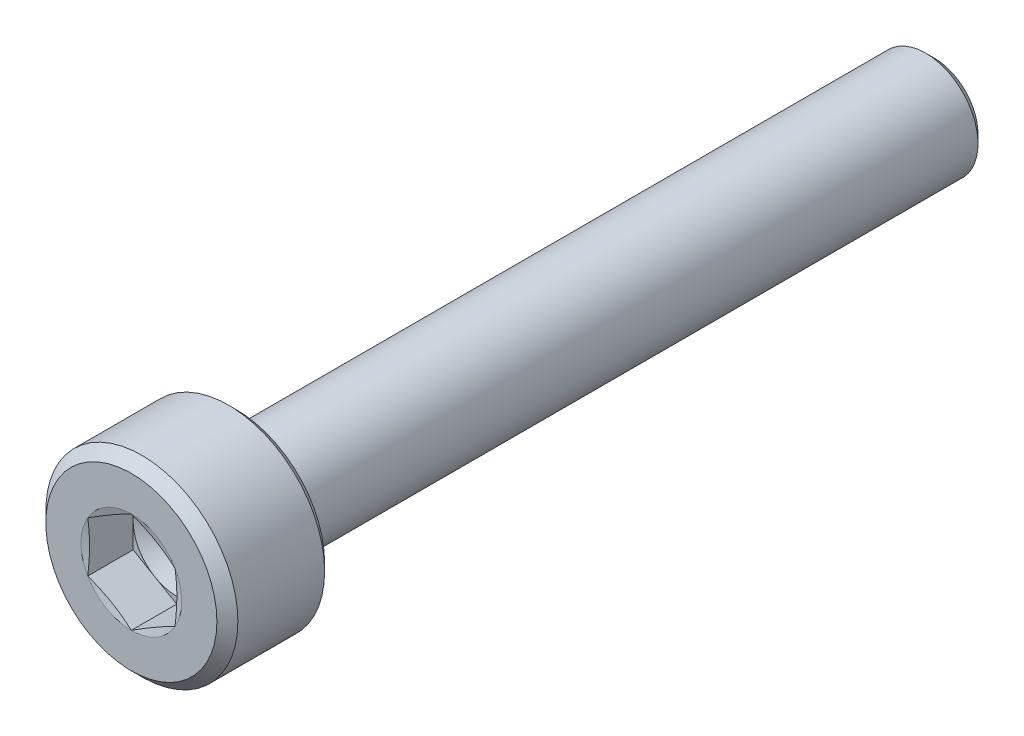
ISO-10303-21;
HEADER;
FILE_DESCRIPTION(('STEP AP214'),'2;1');
FILE_NAME('part.step','',(''),(''),'','','');
FILE_SCHEMA(('AUTOMOTIVE_DESIGN { 1 0 10303 214 1 1 1 1 }'));
ENDSEC;
DATA;
#1=APPLICATION_CONTEXT('core data for automotive mechanical design processes');
#2=APPLICATION_PROTOCOL_DEFINITION('international standard','automotive_design',2000,#1);
#3=PRODUCT_CONTEXT('',#1,'mechanical');
#4=PRODUCT('Part','Part','',(#3));
#5=PRODUCT_RELATED_PRODUCT_CATEGORY('part','',(#4));
#6=PRODUCT_DEFINITION_FORMATION('','',#4);
#7=PRODUCT_DEFINITION_CONTEXT('part definition',#1,'design');
#8=PRODUCT_DEFINITION('design','',#6,#7);
#9=PRODUCT_DEFINITION_SHAPE('','',#8);
#10=(LENGTH_UNIT() NAMED_UNIT(*) SI_UNIT(.MILLI.,.METRE.));
#11=(NAMED_UNIT(*) PLANE_ANGLE_UNIT() SI_UNIT($,.RADIAN.));
#12=(NAMED_UNIT(*) SI_UNIT($,.STERADIAN.) SOLID_ANGLE_UNIT());
#13=UNCERTAINTY_MEASURE_WITH_UNIT(LENGTH_MEASURE(1.E-05),#10,'distance_accuracy_value','');
#14=(GEOMETRIC_REPRESENTATION_CONTEXT(3) GLOBAL_UNCERTAINTY_ASSIGNED_CONTEXT((#13)) GLOBAL_UNIT_ASSIGNED_CONTEXT((#10,
#11,#12)) REPRESENTATION_CONTEXT('',''));
#15=CARTESIAN_POINT('',(0.,0.,0.));
#16=DIRECTION('',(0.,0.,1.));
#17=DIRECTION('',(1.,0.,0.));
#18=AXIS2_PLACEMENT_3D('',#15,#16,#17);
#19=CARTESIAN_POINT('',(0.,0.,0.));
#20=DIRECTION('',(0.,0.,-1.));
#21=DIRECTION('',(-1.,0.,0.));
#22=AXIS2_PLACEMENT_3D('',#19,#20,#21);
#23=PLANE('',#22);
#24=CARTESIAN_POINT('',(0.,0.,0.));
#25=DIRECTION('',(0.,0.,1.));
#26=DIRECTION('',(1.,0.,0.));
#27=AXIS2_PLACEMENT_3D('',#24,#25,#26);
#28=CIRCLE('',#27,2.44999999999999);
#29=CARTESIAN_POINT('',(2.44999999999999,0.,0.));
#30=VERTEX_POINT('',#29);
#31=EDGE_CURVE('E229',#30,#30,#28,.T.);
#32=ORIENTED_EDGE('',*,*,#31,.T.);
#33=EDGE_LOOP('',(#32));
#34=FACE_BOUND('',#33,.T.);
#35=CARTESIAN_POINT('',(0.,0.,0.));
#36=DIRECTION('',(0.,0.,1.));
#37=DIRECTION('',(1.,0.,0.));
#38=AXIS2_PLACEMENT_3D('',#35,#36,#37);
#39=CIRCLE('',#38,1.44337567297407);
#40=CARTESIAN_POINT('',(-1.25,-0.721687836487033,0.));
#41=VERTEX_POINT('',#40);
#42=CARTESIAN_POINT('',(0.,-1.44337567297407,0.));
#43=VERTEX_POINT('',#42);
#44=EDGE_CURVE('E155',#41,#43,#39,.T.);
#45=ORIENTED_EDGE('',*,*,#44,.F.);
#46=CARTESIAN_POINT('',(-1.25,0.721687836487033,0.));
#47=VERTEX_POINT('',#46);
#48=EDGE_CURVE('E154',#47,#41,#39,.T.);
#49=ORIENTED_EDGE('',*,*,#48,.F.);
#50=CARTESIAN_POINT('',(0.,1.44337567297407,0.));
#51=VERTEX_POINT('',#50);
#52=EDGE_CURVE('E121',#51,#47,#39,.T.);
#53=ORIENTED_EDGE('',*,*,#52,.F.);
#54=CARTESIAN_POINT('',(1.25,0.721687836487034,0.));
#55=VERTEX_POINT('',#54);
#56=EDGE_CURVE('E115',#55,#51,#39,.T.);
#57=ORIENTED_EDGE('',*,*,#56,.F.);
#58=CARTESIAN_POINT('',(1.25,-0.721687836487031,0.));
#59=VERTEX_POINT('',#58);
#60=EDGE_CURVE('E123',#59,#55,#39,.T.);
#61=ORIENTED_EDGE('',*,*,#60,.F.);
#62=EDGE_CURVE('E313',#43,#59,#39,.T.);
#63=ORIENTED_EDGE('',*,*,#62,.F.);
#64=EDGE_LOOP('',(#45,#49,#53,#57,#61,#63));
#65=FACE_BOUND('',#64,.T.);
#66=ADVANCED_FACE('F38',(#34,#65),#23,.F.);
#67=CARTESIAN_POINT('',(0.,0.,-0.3));
#68=DIRECTION('',(0.,0.,-1.));
#69=DIRECTION('',(-1.,0.,0.));
#70=AXIS2_PLACEMENT_3D('',#67,#68,#69);
#71=CONICAL_SURFACE('',#70,2.75,0.78539816339746);
#72=ORIENTED_EDGE('',*,*,#31,.F.);
#73=EDGE_LOOP('',(#72));
#74=FACE_BOUND('',#73,.T.);
#75=CARTESIAN_POINT('',(0.,0.,-0.3));
#76=DIRECTION('',(0.,0.,1.));
#77=DIRECTION('',(1.,0.,0.));
#78=AXIS2_PLACEMENT_3D('',#75,#76,#77);
#79=CIRCLE('',#78,2.75);
#80=CARTESIAN_POINT('',(2.75,0.,-0.3));
#81=VERTEX_POINT('',#80);
#82=EDGE_CURVE('E231',#81,#81,#79,.T.);
#83=ORIENTED_EDGE('',*,*,#82,.T.);
#84=EDGE_LOOP('',(#83));
#85=FACE_BOUND('',#84,.T.);
#86=ADVANCED_FACE('F220',(#74,#85),#71,.T.);
#87=CARTESIAN_POINT('',(0.,0.,0.));
#88=DIRECTION('',(0.,0.,1.));
#89=DIRECTION('',(1.,0.,0.));
#90=AXIS2_PLACEMENT_3D('',#87,#88,#89);
#91=CYLINDRICAL_SURFACE('',#90,2.75);
#92=ORIENTED_EDGE('',*,*,#82,.F.);
#93=EDGE_LOOP('',(#92));
#94=FACE_BOUND('',#93,.T.);
#95=CARTESIAN_POINT('',(0.,0.,-2.785));
#96=DIRECTION('',(0.,0.,1.));
#97=DIRECTION('',(1.,0.,0.));
#98=AXIS2_PLACEMENT_3D('',#95,#96,#97);
#99=CIRCLE('',#98,2.75);
#100=CARTESIAN_POINT('',(2.75,0.,-2.785));
#101=VERTEX_POINT('',#100);
#102=EDGE_CURVE('E234',#101,#101,#99,.T.);
#103=ORIENTED_EDGE('',*,*,#102,.T.);
#104=EDGE_LOOP('',(#103));
#105=FACE_BOUND('',#104,.T.);
#106=ADVANCED_FACE('F225',(#94,#105),#91,.T.);
#107=CARTESIAN_POINT('',(0.,0.,-3.));
#108=DIRECTION('',(0.,0.,1.));
#109=DIRECTION('',(1.,0.,0.));
#110=AXIS2_PLACEMENT_3D('',#107,#108,#109);
#111=CONICAL_SURFACE('',#110,2.535,0.785398163397449);
#112=ORIENTED_EDGE('',*,*,#102,.F.);
#113=EDGE_LOOP('',(#112));
#114=FACE_BOUND('',#113,.T.);
#115=CARTESIAN_POINT('',(0.,0.,-3.));
#116=DIRECTION('',(0.,0.,1.));
#117=DIRECTION('',(1.,0.,0.));
#118=AXIS2_PLACEMENT_3D('',#115,#116,#117);
#119=CIRCLE('',#118,2.535);
#120=CARTESIAN_POINT('',(2.535,0.,-3.));
#121=VERTEX_POINT('',#120);
#122=EDGE_CURVE('E239',#121,#121,#119,.T.);
#123=ORIENTED_EDGE('',*,*,#122,.T.);
#124=EDGE_LOOP('',(#123));
#125=FACE_BOUND('',#124,.T.);
#126=ADVANCED_FACE('F429',(#114,#125),#111,.T.);
#127=CARTESIAN_POINT('',(0.,2.535,-3.));
#128=DIRECTION('',(0.,0.,1.));
#129=DIRECTION('',(1.,0.,0.));
#130=AXIS2_PLACEMENT_3D('',#127,#128,#129);
#131=PLANE('',#130);
#132=ORIENTED_EDGE('',*,*,#122,.F.);
#133=EDGE_LOOP('',(#132));
#134=FACE_BOUND('',#133,.T.);
#135=CARTESIAN_POINT('',(0.,0.,-3.));
#136=DIRECTION('',(0.,0.,1.));
#137=DIRECTION('',(1.,0.,0.));
#138=AXIS2_PLACEMENT_3D('',#135,#136,#137);
#139=CIRCLE('',#138,1.8);
#140=CARTESIAN_POINT('',(1.8,0.,-3.));
#141=VERTEX_POINT('',#140);
#142=EDGE_CURVE('E242',#141,#141,#139,.T.);
#143=ORIENTED_EDGE('',*,*,#142,.T.);
#144=EDGE_LOOP('',(#143));
#145=FACE_BOUND('',#144,.T.);
#146=ADVANCED_FACE('F421',(#134,#145),#131,.F.);
#147=CARTESIAN_POINT('',(0.,0.,-3.1));
#148=DIRECTION('',(0.,0.,1.));
#149=DIRECTION('',(1.,0.,0.));
#150=AXIS2_PLACEMENT_3D('',#147,#148,#149);
#151=TOROIDAL_SURFACE('',#150,1.8,0.1);
#152=ORIENTED_EDGE('',*,*,#142,.F.);
#153=EDGE_LOOP('',(#152));
#154=FACE_BOUND('',#153,.T.);
#155=CARTESIAN_POINT('',(0.,0.,-3.05615763679786));
#156=DIRECTION('',(0.,0.,1.));
#157=DIRECTION('',(1.,0.,0.));
#158=AXIS2_PLACEMENT_3D('',#155,#156,#157);
#159=CIRCLE('',#158,1.71012315543561);
#160=CARTESIAN_POINT('',(1.71012315543561,0.,-3.05615763679786));
#161=VERTEX_POINT('',#160);
#162=EDGE_CURVE('E245',#161,#161,#159,.T.);
#163=ORIENTED_EDGE('',*,*,#162,.T.);
#164=EDGE_LOOP('',(#163));
#165=FACE_BOUND('',#164,.T.);
#166=ADVANCED_FACE('F413',(#154,#165),#151,.F.);
#167=CARTESIAN_POINT('',(0.,0.,-3.46615763679786));
#168=DIRECTION('',(0.,0.,1.));
#169=DIRECTION('',(1.,0.,0.));
#170=AXIS2_PLACEMENT_3D('',#167,#168,#169);
#171=CONICAL_SURFACE('',#170,1.51012315543561,0.453844001521511);
#172=ORIENTED_EDGE('',*,*,#162,.F.);
#173=EDGE_LOOP('',(#172));
#174=FACE_BOUND('',#173,.T.);
#175=CARTESIAN_POINT('',(0.,0.,-3.46615763679786));
#176=DIRECTION('',(0.,0.,1.));
#177=DIRECTION('',(1.,0.,0.));
#178=AXIS2_PLACEMENT_3D('',#175,#176,#177);
#179=CIRCLE('',#178,1.51012315543561);
#180=CARTESIAN_POINT('',(1.51012315543561,0.,-3.46615763679786));
#181=VERTEX_POINT('',#180);
#182=EDGE_CURVE('E248',#181,#181,#179,.T.);
#183=ORIENTED_EDGE('',*,*,#182,.T.);
#184=EDGE_LOOP('',(#183));
#185=FACE_BOUND('',#184,.T.);
#186=ADVANCED_FACE('F405',(#174,#185),#171,.T.);
#187=CARTESIAN_POINT('',(0.,0.,-3.51));
#188=DIRECTION('',(0.,0.,1.));
#189=DIRECTION('',(1.,0.,0.));
#190=AXIS2_PLACEMENT_3D('',#187,#188,#189);
#191=TOROIDAL_SURFACE('',#190,1.6,0.1);
#192=ORIENTED_EDGE('',*,*,#182,.F.);
#193=EDGE_LOOP('',(#192));
#194=FACE_BOUND('',#193,.T.);
#195=CARTESIAN_POINT('',(0.,0.,-3.51));
#196=DIRECTION('',(0.,0.,1.));
#197=DIRECTION('',(1.,0.,0.));
#198=AXIS2_PLACEMENT_3D('',#195,#196,#197);
#199=CIRCLE('',#198,1.5);
#200=CARTESIAN_POINT('',(1.5,0.,-3.51));
#201=VERTEX_POINT('',#200);
#202=EDGE_CURVE('E251',#201,#201,#199,.T.);
#203=ORIENTED_EDGE('',*,*,#202,.T.);
#204=EDGE_LOOP('',(#203));
#205=FACE_BOUND('',#204,.T.);
#206=ADVANCED_FACE('F397',(#194,#205),#191,.F.);
#207=CARTESIAN_POINT('',(0.,0.,0.));
#208=DIRECTION('',(0.,0.,1.));
#209=DIRECTION('',(1.,0.,0.));
#210=AXIS2_PLACEMENT_3D('',#207,#208,#209);
#211=CYLINDRICAL_SURFACE('',#210,1.5);
#212=ORIENTED_EDGE('',*,*,#202,.F.);
#213=EDGE_LOOP('',(#212));
#214=FACE_BOUND('',#213,.T.);
#215=CARTESIAN_POINT('',(0.,0.,-22.75));
#216=DIRECTION('',(0.,0.,1.));
#217=DIRECTION('',(1.,0.,0.));
#218=AXIS2_PLACEMENT_3D('',#215,#216,#217);
#219=CIRCLE('',#218,1.5);
#220=CARTESIAN_POINT('',(1.5,0.,-22.75));
#221=VERTEX_POINT('',#220);
#222=EDGE_CURVE('E254',#221,#221,#219,.T.);
#223=ORIENTED_EDGE('',*,*,#222,.T.);
#224=EDGE_LOOP('',(#223));
#225=FACE_BOUND('',#224,.T.);
#226=ADVANCED_FACE('F388',(#214,#225),#211,.T.);
#227=CARTESIAN_POINT('',(0.,0.,-23.));
#228=DIRECTION('',(0.,0.,1.));
#229=DIRECTION('',(1.,0.,0.));
#230=AXIS2_PLACEMENT_3D('',#227,#228,#229);
#231=CONICAL_SURFACE('',#230,1.25,0.785398163397441);
#232=ORIENTED_EDGE('',*,*,#222,.F.);
#233=EDGE_LOOP('',(#232));
#234=FACE_BOUND('',#233,.T.);
#235=CARTESIAN_POINT('',(0.,0.,-23.));
#236=DIRECTION('',(0.,0.,1.));
#237=DIRECTION('',(1.,0.,0.));
#238=AXIS2_PLACEMENT_3D('',#235,#236,#237);
#239=CIRCLE('',#238,1.25);
#240=CARTESIAN_POINT('',(1.25,0.,-23.));
#241=VERTEX_POINT('',#240);
#242=EDGE_CURVE('E257',#241,#241,#239,.T.);
#243=ORIENTED_EDGE('',*,*,#242,.T.);
#244=EDGE_LOOP('',(#243));
#245=FACE_BOUND('',#244,.T.);
#246=ADVANCED_FACE('F380',(#234,#245),#231,.T.);
#247=CARTESIAN_POINT('',(0.,1.25,-23.));
#248=DIRECTION('',(0.,0.,1.));
#249=DIRECTION('',(1.,0.,0.));
#250=AXIS2_PLACEMENT_3D('',#247,#248,#249);
#251=PLANE('',#250);
#252=ORIENTED_EDGE('',*,*,#242,.F.);
#253=EDGE_LOOP('',(#252));
#254=FACE_BOUND('',#253,.T.);
#255=ADVANCED_FACE('F374',(#254),#251,.F.);
#256=CARTESIAN_POINT('',(0.,0.,-0.0518148554092243));
#257=DIRECTION('',(0.,0.,1.));
#258=DIRECTION('',(1.,0.,0.));
#259=AXIS2_PLACEMENT_3D('',#256,#257,#258);
#260=CONICAL_SURFACE('',#259,1.25,1.30899693899575);
#261=ORIENTED_EDGE('',*,*,#52,.T.);
#262=CARTESIAN_POINT('',(-1.2502,0.721572366433195,3.09438201916871E-05));
#263=CARTESIAN_POINT('',(-1.19827409383526,0.751551802335321,-0.00800698378926622));
#264=CARTESIAN_POINT('',(-1.14625401362102,0.781585609650283,-0.0153042105125454));
#265=CARTESIAN_POINT('',(-1.04203006351459,0.841759335300235,-0.0281248924452036));
#266=CARTESIAN_POINT('',(-0.989826127596593,0.871899291755248,-0.0336476265269101));
#267=CARTESIAN_POINT('',(-0.88555111655682,0.932102497448812,-0.0425967858491088));
#268=CARTESIAN_POINT('',(-0.833480747184869,0.962165339222511,-0.0460338877791617));
#269=CARTESIAN_POINT('',(-0.729273575326724,1.0223293779463,-0.0506427032068));
#270=CARTESIAN_POINT('',(-0.677136787663362,1.05243056633842,-0.0518148554092241));
#271=CARTESIAN_POINT('',(-0.572863212336638,1.11263294312267,-0.0518148554092241));
#272=CARTESIAN_POINT('',(-0.520726424673275,1.1427341315148,-0.0506427032068001));
#273=CARTESIAN_POINT('',(-0.416519252815131,1.20289817023859,-0.0460338877791617));
#274=CARTESIAN_POINT('',(-0.36444888344318,1.23296101201229,-0.0425967858491088));
#275=CARTESIAN_POINT('',(-0.260173872403407,1.29316421770585,-0.03364762652691));
#276=CARTESIAN_POINT('',(-0.207969936485411,1.32330417416086,-0.0281248924452036));
#277=CARTESIAN_POINT('',(-0.103745986378985,1.38347789981082,-0.0153042105125453));
#278=CARTESIAN_POINT('',(-0.0517259061647358,1.41351170712578,-0.00800698378926612));
#279=CARTESIAN_POINT('',(0.00020000000000038,1.4434911430279,3.09438201918299E-05));
#280=B_SPLINE_CURVE_WITH_KNOTS('',3,(#262,#263,#264,#265,#266,#267,#268,#269,#270,#271,#272,
#273,#274,#275,#276,#277,#278,#279),.UNSPECIFIED.,.F.,.F.,(4,2,2,2,2,2,2,2,4),(0.,
0.18149525192516,0.363064167833313,0.543695584294992,0.724292010212745,0.9048884361305,
1.08551985259218,1.26708876850033,1.44858402042549),.UNSPECIFIED.);
#281=EDGE_CURVE('E11',#47,#51,#280,.T.);
#282=ORIENTED_EDGE('',*,*,#281,.T.);
#283=EDGE_LOOP('',(#261,#282));
#284=FACE_BOUND('',#283,.T.);
#285=ADVANCED_FACE('F127',(#284),#260,.F.);
#286=CARTESIAN_POINT('',(-1.25,-1.90803764372689,0.224449375411132));
#287=CARTESIAN_POINT('',(-1.25,-1.8513410457493,0.21174373926854));
#288=CARTESIAN_POINT('',(-1.25,-1.79460907964503,0.199195804458375));
#289=CARTESIAN_POINT('',(-1.25,-1.68105673477474,0.174495010900465));
#290=CARTESIAN_POINT('',(-1.25,-1.62423635229394,0.162342169249333));
#291=CARTESIAN_POINT('',(-1.25,-1.4535135757121,0.126574423752231));
#292=CARTESIAN_POINT('',(-1.25,-1.33945900339908,0.103675151182616));
#293=CARTESIAN_POINT('',(-1.25,-1.11170727260793,0.0609587630346281));
#294=CARTESIAN_POINT('',(-1.25,-0.998014548362105,0.0411184667683871));
#295=CARTESIAN_POINT('',(-1.25,-0.769948454688276,0.00583266905587686));
#296=CARTESIAN_POINT('',(-1.25,-0.655575207287998,-0.00961359741797872));
#297=CARTESIAN_POINT('',(-1.25,-0.424787181644499,-0.0341426384914952));
#298=CARTESIAN_POINT('',(-1.25,-0.308363938645654,-0.0431515305449703));
#299=CARTESIAN_POINT('',(-1.25,-0.133499226938177,-0.0502674214127566));
#300=CARTESIAN_POINT('',(-1.25,-0.0751823293286765,-0.0515734559811251));
#301=CARTESIAN_POINT('',(-1.25,0.0414593912908041,-0.0519953132862497));
#302=CARTESIAN_POINT('',(-1.25,0.0997842142946219,-0.0511111377164467));
#303=CARTESIAN_POINT('',(-1.25,0.275064939261687,-0.0452058780708578));
#304=CARTESIAN_POINT('',(-1.25,0.391917619612776,-0.0369155048717787));
#305=CARTESIAN_POINT('',(-1.25,0.624955711707257,-0.013420604100275));
#306=CARTESIAN_POINT('',(-1.25,0.741140574853819,0.00178895996036897));
#307=CARTESIAN_POINT('',(-1.25,0.965009686747211,0.0357098573203466));
#308=CARTESIAN_POINT('',(-1.25,1.07274149713457,0.0541179629895213));
#309=CARTESIAN_POINT('',(-1.25,1.28770836040789,0.0936619087242774));
#310=CARTESIAN_POINT('',(-1.25,1.39494334881407,0.114798093117207));
#311=CARTESIAN_POINT('',(-1.25,1.60905523406172,0.158897571848756));
#312=CARTESIAN_POINT('',(-1.25,1.71593205434096,0.181861233731142));
#313=CARTESIAN_POINT('',(-1.25,1.92941059122614,0.229035853527515));
#314=CARTESIAN_POINT('',(-1.25,2.0360123020935,0.253246837242345));
#315=CARTESIAN_POINT('',(-1.25,2.24796149236902,0.302300913060499));
#316=CARTESIAN_POINT('',(-1.25,2.35331096915779,0.32713541151495));
#317=CARTESIAN_POINT('',(-1.25,2.56386296226419,0.377426560036597));
#318=CARTESIAN_POINT('',(-1.25,2.66906547587909,0.402883221390532));
#319=CARTESIAN_POINT('',(-1.25,2.87922866754162,0.454224569867166));
#320=CARTESIAN_POINT('',(-1.25,2.98418948388924,0.4801086920956));
#321=CARTESIAN_POINT('',(-1.25,3.19401964928918,0.53223064686748));
#322=CARTESIAN_POINT('',(-1.25,3.29888900123911,0.558468467737611));
#323=CARTESIAN_POINT('',(-1.25,3.40372646605654,0.5848316076134));
#324=B_SPLINE_CURVE_WITH_KNOTS('',3,(#286,#287,#288,#289,#290,#291,#292,#293,#294,#295,#296,
#297,#298,#299,#300,#301,#302,#303,#304,#305,#306,#307,#308,#309,#310,#311,#312,#313,#314,#315,
#316,#317,#318,#319,#320,#321,#322,#323),.UNSPECIFIED.,.F.,.F.,(4,2,2,2,2,2,2,2,2,2,2,2,2,2,2,2,
2,2,4),(0.,0.17430798332962,0.348623499364559,0.697591208701206,1.04376859165833,
1.38988566606611,1.73991400543005,1.91487041156219,2.08982668242046,2.44096537417444,
2.79236007022679,3.12019018011378,3.44806170796195,3.77599934506425,4.10394376827983,
4.4286525086615,4.75336714400545,5.07768244044904,5.40198705941089),.UNSPECIFIED.);
#325=EDGE_CURVE('E120',#41,#47,#324,.T.);
#326=ORIENTED_EDGE('',*,*,#325,.T.);
#327=ORIENTED_EDGE('',*,*,#48,.T.);
#328=EDGE_LOOP('',(#326,#327));
#329=FACE_BOUND('',#328,.T.);
#330=ADVANCED_FACE('F361',(#329),#260,.F.);
#331=CARTESIAN_POINT('',(0.000199999999999765,-1.4434911430279,3.09438201913897E-05));
#332=CARTESIAN_POINT('',(-0.0517259061647364,-1.41351170712578,-0.0080069837892665));
#333=CARTESIAN_POINT('',(-0.103745986378985,-1.38347789981081,-0.0153042105125457));
#334=CARTESIAN_POINT('',(-0.207969936485412,-1.32330417416086,-0.028124892445204));
#335=CARTESIAN_POINT('',(-0.260173872403408,-1.29316421770585,-0.0336476265269104));
#336=CARTESIAN_POINT('',(-0.36444888344318,-1.23296101201229,-0.0425967858491091));
#337=CARTESIAN_POINT('',(-0.416519252815131,-1.20289817023859,-0.046033887779162));
#338=CARTESIAN_POINT('',(-0.520726424673276,-1.1427341315148,-0.0506427032068003));
#339=CARTESIAN_POINT('',(-0.572863212336638,-1.11263294312267,-0.0518148554092244));
#340=CARTESIAN_POINT('',(-0.677136787663362,-1.05243056633842,-0.0518148554092244));
#341=CARTESIAN_POINT('',(-0.729273575326725,-1.0223293779463,-0.0506427032068003));
#342=CARTESIAN_POINT('',(-0.833480747184869,-0.962165339222509,-0.046033887779162));
#343=CARTESIAN_POINT('',(-0.88555111655682,-0.93210249744881,-0.0425967858491091));
#344=CARTESIAN_POINT('',(-0.989826127596593,-0.871899291755246,-0.0336476265269103));
#345=CARTESIAN_POINT('',(-1.04203006351459,-0.841759335300233,-0.0281248924452038));
#346=CARTESIAN_POINT('',(-1.14625401362102,-0.781585609650282,-0.0153042105125455));
#347=CARTESIAN_POINT('',(-1.19827409383526,-0.75155180233532,-0.00800698378926632));
#348=CARTESIAN_POINT('',(-1.2502,-0.721572366433194,3.09438201915463E-05));
#349=B_SPLINE_CURVE_WITH_KNOTS('',3,(#331,#332,#333,#334,#335,#336,#337,#338,#339,#340,#341,
#342,#343,#344,#345,#346,#347,#348),.UNSPECIFIED.,.F.,.F.,(4,2,2,2,2,2,2,2,4),(0.,
0.18149525192516,0.363064167833313,0.543695584294991,0.724292010212745,0.904888436130499,
1.08551985259218,1.26708876850033,1.44858402042549),.UNSPECIFIED.);
#350=EDGE_CURVE('E163',#43,#41,#349,.T.);
#351=ORIENTED_EDGE('',*,*,#350,.T.);
#352=ORIENTED_EDGE('',*,*,#44,.T.);
#353=EDGE_LOOP('',(#351,#352));
#354=FACE_BOUND('',#353,.T.);
#355=ADVANCED_FACE('F355',(#354),#260,.F.);
#356=CARTESIAN_POINT('',(1.2502,-0.721572366433195,3.09438201914613E-05));
#357=CARTESIAN_POINT('',(1.19827409383526,-0.75155180233532,-0.00800698378926647));
#358=CARTESIAN_POINT('',(1.14625401362101,-0.781585609650283,-0.0153042105125457));
#359=CARTESIAN_POINT('',(1.04203006351459,-0.841759335300234,-0.0281248924452039));
#360=CARTESIAN_POINT('',(0.989826127596592,-0.871899291755247,-0.0336476265269103));
#361=CARTESIAN_POINT('',(0.88555111655682,-0.932102497448811,-0.042596785849109));
#362=CARTESIAN_POINT('',(0.833480747184869,-0.96216533922251,-0.046033887779162));
#363=CARTESIAN_POINT('',(0.729273575326724,-1.0223293779463,-0.0506427032068003));
#364=CARTESIAN_POINT('',(0.677136787663362,-1.05243056633842,-0.0518148554092244));
#365=CARTESIAN_POINT('',(0.572863212336637,-1.11263294312267,-0.0518148554092244));
#366=CARTESIAN_POINT('',(0.520726424673275,-1.1427341315148,-0.0506427032068003));
#367=CARTESIAN_POINT('',(0.416519252815131,-1.20289817023859,-0.046033887779162));
#368=CARTESIAN_POINT('',(0.36444888344318,-1.23296101201229,-0.042596785849109));
#369=CARTESIAN_POINT('',(0.260173872403407,-1.29316421770585,-0.0336476265269103));
#370=CARTESIAN_POINT('',(0.207969936485411,-1.32330417416086,-0.028124892445204));
#371=CARTESIAN_POINT('',(0.103745986378985,-1.38347789981081,-0.0153042105125458));
#372=CARTESIAN_POINT('',(0.0517259061647362,-1.41351170712578,-0.00800698378926656));
#373=CARTESIAN_POINT('',(-0.000200000000000036,-1.4434911430279,3.09438201914066E-05));
#374=B_SPLINE_CURVE_WITH_KNOTS('',3,(#356,#357,#358,#359,#360,#361,#362,#363,#364,#365,#366,
#367,#368,#369,#370,#371,#372,#373),.UNSPECIFIED.,.F.,.F.,(4,2,2,2,2,2,2,2,4),(0.,
0.18149525192516,0.363064167833312,0.543695584294991,0.724292010212745,0.904888436130499,
1.08551985259218,1.26708876850033,1.44858402042549),.UNSPECIFIED.);
#375=EDGE_CURVE('E183',#59,#43,#374,.T.);
#376=ORIENTED_EDGE('',*,*,#375,.T.);
#377=ORIENTED_EDGE('',*,*,#62,.T.);
#378=EDGE_LOOP('',(#376,#377));
#379=FACE_BOUND('',#378,.T.);
#380=ADVANCED_FACE('F349',(#379),#260,.F.);
#381=CARTESIAN_POINT('',(1.25,-1.90803764372689,0.224449375411132));
#382=CARTESIAN_POINT('',(1.25,-1.8513410457493,0.21174373926854));
#383=CARTESIAN_POINT('',(1.25,-1.79460907964503,0.199195804458375));
#384=CARTESIAN_POINT('',(1.25,-1.68105673477474,0.174495010900465));
#385=CARTESIAN_POINT('',(1.25,-1.62423635229394,0.162342169249333));
#386=CARTESIAN_POINT('',(1.25,-1.4535135757121,0.126574423752231));
#387=CARTESIAN_POINT('',(1.25,-1.33945900339908,0.103675151182616));
#388=CARTESIAN_POINT('',(1.25,-1.11170727260793,0.0609587630346278));
#389=CARTESIAN_POINT('',(1.25,-0.998014548362105,0.0411184667683869));
#390=CARTESIAN_POINT('',(1.25,-0.769948454688276,0.00583266905587672));
#391=CARTESIAN_POINT('',(1.25,-0.655575207287999,-0.00961359741797884));
#392=CARTESIAN_POINT('',(1.25,-0.4247871816445,-0.0341426384914953));
#393=CARTESIAN_POINT('',(1.25,-0.308363938645655,-0.0431515305449704));
#394=CARTESIAN_POINT('',(1.25,-0.133499226938178,-0.0502674214127568));
#395=CARTESIAN_POINT('',(1.25,-0.0751823293286781,-0.0515734559811252));
#396=CARTESIAN_POINT('',(1.25,0.0414593912908024,-0.0519953132862499));
#397=CARTESIAN_POINT('',(1.25,0.0997842142946203,-0.0511111377164469));
#398=CARTESIAN_POINT('',(1.25,0.275064939261685,-0.045205878070858));
#399=CARTESIAN_POINT('',(1.25,0.391917619612775,-0.036915504871779));
#400=CARTESIAN_POINT('',(1.25,0.624955711707256,-0.0134206041002753));
#401=CARTESIAN_POINT('',(1.25,0.741140574853817,0.00178895996036867));
#402=CARTESIAN_POINT('',(1.25,0.96500968674721,0.0357098573203462));
#403=CARTESIAN_POINT('',(1.25,1.07274149713457,0.054117962989521));
#404=CARTESIAN_POINT('',(1.25,1.28770836040789,0.093661908724277));
#405=CARTESIAN_POINT('',(1.25,1.39494334881407,0.114798093117207));
#406=CARTESIAN_POINT('',(1.25,1.60905523406172,0.158897571848756));
#407=CARTESIAN_POINT('',(1.25,1.71593205434096,0.181861233731142));
#408=CARTESIAN_POINT('',(1.25,1.92941059122614,0.229035853527516));
#409=CARTESIAN_POINT('',(1.25,2.0360123020935,0.253246837242345));
#410=CARTESIAN_POINT('',(1.25,2.24796149236902,0.302300913060499));
#411=CARTESIAN_POINT('',(1.25,2.35331096915779,0.32713541151495));
#412=CARTESIAN_POINT('',(1.25,2.56386296226419,0.377426560036597));
#413=CARTESIAN_POINT('',(1.25,2.66906547587909,0.402883221390532));
#414=CARTESIAN_POINT('',(1.25,2.87922866754162,0.454224569867166));
#415=CARTESIAN_POINT('',(1.25,2.98418948388924,0.4801086920956));
#416=CARTESIAN_POINT('',(1.25,3.19401964928918,0.53223064686748));
#417=CARTESIAN_POINT('',(1.25,3.29888900123911,0.558468467737611));
#418=CARTESIAN_POINT('',(1.25,3.40372646605654,0.5848316076134));
#419=B_SPLINE_CURVE_WITH_KNOTS('',3,(#381,#382,#383,#384,#385,#386,#387,#388,#389,#390,#391,
#392,#393,#394,#395,#396,#397,#398,#399,#400,#401,#402,#403,#404,#405,#406,#407,#408,#409,#410,
#411,#412,#413,#414,#415,#416,#417,#418),.UNSPECIFIED.,.F.,.F.,(4,2,2,2,2,2,2,2,2,2,2,2,2,2,2,2,
2,2,4),(0.,0.17430798332962,0.348623499364559,0.697591208701206,1.04376859165833,
1.38988566606611,1.73991400543005,1.91487041156219,2.08982668242046,2.44096537417444,
2.79236007022679,3.12019018011378,3.44806170796195,3.77599934506425,4.10394376827983,
4.4286525086615,4.75336714400545,5.07768244044904,5.40198705941089),.UNSPECIFIED.);
#420=EDGE_CURVE('E63',#55,#59,#419,.F.);
#421=ORIENTED_EDGE('',*,*,#420,.T.);
#422=ORIENTED_EDGE('',*,*,#60,.T.);
#423=EDGE_LOOP('',(#421,#422));
#424=FACE_BOUND('',#423,.T.);
#425=ADVANCED_FACE('F176',(#424),#260,.F.);
#426=CARTESIAN_POINT('',(-0.000199999999999885,1.4434911430279,3.09438201917452E-05));
#427=CARTESIAN_POINT('',(0.0517259061647365,1.41351170712578,-0.00800698378926616));
#428=CARTESIAN_POINT('',(0.103745986378985,1.38347789981081,-0.0153042105125454));
#429=CARTESIAN_POINT('',(0.207969936485411,1.32330417416086,-0.0281248924452036));
#430=CARTESIAN_POINT('',(0.260173872403408,1.29316421770585,-0.03364762652691));
#431=CARTESIAN_POINT('',(0.36444888344318,1.23296101201229,-0.0425967858491087));
#432=CARTESIAN_POINT('',(0.416519252815131,1.20289817023859,-0.0460338877791617));
#433=CARTESIAN_POINT('',(0.520726424673275,1.1427341315148,-0.0506427032068));
#434=CARTESIAN_POINT('',(0.572863212336638,1.11263294312267,-0.0518148554092241));
#435=CARTESIAN_POINT('',(0.677136787663362,1.05243056633842,-0.0518148554092242));
#436=CARTESIAN_POINT('',(0.729273575326724,1.0223293779463,-0.0506427032068001));
#437=CARTESIAN_POINT('',(0.833480747184869,0.962165339222511,-0.0460338877791617));
#438=CARTESIAN_POINT('',(0.88555111655682,0.932102497448812,-0.0425967858491088));
#439=CARTESIAN_POINT('',(0.989826127596592,0.871899291755248,-0.0336476265269101));
#440=CARTESIAN_POINT('',(1.04203006351459,0.841759335300235,-0.0281248924452037));
#441=CARTESIAN_POINT('',(1.14625401362101,0.781585609650283,-0.0153042105125454));
#442=CARTESIAN_POINT('',(1.19827409383526,0.751551802335321,-0.00800698378926624));
#443=CARTESIAN_POINT('',(1.2502,0.721572366433195,3.09438201916591E-05));
#444=B_SPLINE_CURVE_WITH_KNOTS('',3,(#426,#427,#428,#429,#430,#431,#432,#433,#434,#435,#436,
#437,#438,#439,#440,#441,#442,#443),.UNSPECIFIED.,.F.,.F.,(4,2,2,2,2,2,2,2,4),(0.,
0.18149525192516,0.363064167833313,0.543695584294991,0.724292010212745,0.904888436130499,
1.08551985259218,1.26708876850033,1.44858402042549),.UNSPECIFIED.);
#445=EDGE_CURVE('E57',#51,#55,#444,.T.);
#446=ORIENTED_EDGE('',*,*,#445,.T.);
#447=ORIENTED_EDGE('',*,*,#56,.T.);
#448=EDGE_LOOP('',(#446,#447));
#449=FACE_BOUND('',#448,.T.);
#450=ADVANCED_FACE('F116',(#449),#260,.F.);
#451=CARTESIAN_POINT('',(0.,0.,-2.02168783648703));
#452=DIRECTION('',(0.,0.,1.));
#453=DIRECTION('',(1.,0.,0.));
#454=AXIS2_PLACEMENT_3D('',#451,#452,#453);
#455=CONICAL_SURFACE('',#454,0.,1.0471975511966);
#456=CARTESIAN_POINT('',(0.,0.,-1.3));
#457=DIRECTION('',(0.,0.,1.));
#458=DIRECTION('',(1.,0.,0.));
#459=AXIS2_PLACEMENT_3D('',#456,#457,#458);
#460=CIRCLE('',#459,1.25);
#461=CARTESIAN_POINT('',(1.25,0.,-1.3));
#462=VERTEX_POINT('',#461);
#463=CARTESIAN_POINT('',(0.625,1.08253175473055,-1.3));
#464=VERTEX_POINT('',#463);
#465=EDGE_CURVE('E143',#462,#464,#460,.T.);
#466=ORIENTED_EDGE('',*,*,#465,.T.);
#467=CARTESIAN_POINT('',(-0.625,1.08253175473055,-1.3));
#468=VERTEX_POINT('',#467);
#469=EDGE_CURVE('E51',#464,#468,#460,.T.);
#470=ORIENTED_EDGE('',*,*,#469,.T.);
#471=CARTESIAN_POINT('',(-1.25,0.,-1.3));
#472=VERTEX_POINT('',#471);
#473=EDGE_CURVE('E294',#468,#472,#460,.T.);
#474=ORIENTED_EDGE('',*,*,#473,.T.);
#475=CARTESIAN_POINT('',(-0.625,-1.08253175473055,-1.3));
#476=VERTEX_POINT('',#475);
#477=EDGE_CURVE('E296',#472,#476,#460,.T.);
#478=ORIENTED_EDGE('',*,*,#477,.T.);
#479=CARTESIAN_POINT('',(0.624999999999999,-1.08253175473055,-1.3));
#480=VERTEX_POINT('',#479);
#481=EDGE_CURVE('E232',#476,#480,#460,.T.);
#482=ORIENTED_EDGE('',*,*,#481,.T.);
#483=EDGE_CURVE('E230',#480,#462,#460,.T.);
#484=ORIENTED_EDGE('',*,*,#483,.T.);
#485=EDGE_LOOP('',(#466,#470,#474,#478,#482,#484));
#486=FACE_BOUND('',#485,.T.);
#487=CARTESIAN_POINT('',(0.,0.,-2.02168783648703));
#488=VERTEX_POINT('',#487);
#489=VERTEX_LOOP('',#488);
#490=FACE_BOUND('',#489,.T.);
#491=ADVANCED_FACE('F175',(#486,#490),#455,.F.);
#492=CARTESIAN_POINT('',(0.,0.,-1.3));
#493=DIRECTION('',(0.,0.,1.));
#494=DIRECTION('',(1.,0.,0.));
#495=AXIS2_PLACEMENT_3D('',#492,#493,#494);
#496=PLANE('',#495);
#497=ORIENTED_EDGE('',*,*,#465,.F.);
#498=DIRECTION('',(0.,1.,0.));
#499=VECTOR('',#498,1.);
#500=CARTESIAN_POINT('',(1.25,-0.721687836487033,-1.3));
#501=LINE('',#500,#499);
#502=CARTESIAN_POINT('',(1.25,0.721687836487033,-1.3));
#503=VERTEX_POINT('',#502);
#504=EDGE_CURVE('E273',#462,#503,#501,.T.);
#505=ORIENTED_EDGE('',*,*,#504,.T.);
#506=DIRECTION('',(-0.866025403784439,0.5,0.));
#507=VECTOR('',#506,1.);
#508=CARTESIAN_POINT('',(1.25,0.721687836487033,-1.3));
#509=LINE('',#508,#507);
#510=EDGE_CURVE('E288',#503,#464,#509,.T.);
#511=ORIENTED_EDGE('',*,*,#510,.T.);
#512=EDGE_LOOP('',(#497,#505,#511));
#513=FACE_BOUND('',#512,.T.);
#514=ADVANCED_FACE('F318',(#513),#496,.T.);
#515=ORIENTED_EDGE('',*,*,#483,.F.);
#516=DIRECTION('',(0.866025403784439,0.5,0.));
#517=VECTOR('',#516,1.);
#518=CARTESIAN_POINT('',(0.,-1.44337567297406,-1.3));
#519=LINE('',#518,#517);
#520=CARTESIAN_POINT('',(1.25,-0.721687836487033,-1.3));
#521=VERTEX_POINT('',#520);
#522=EDGE_CURVE('E277',#480,#521,#519,.T.);
#523=ORIENTED_EDGE('',*,*,#522,.T.);
#524=EDGE_CURVE('E150',#521,#462,#501,.T.);
#525=ORIENTED_EDGE('',*,*,#524,.T.);
#526=EDGE_LOOP('',(#515,#523,#525));
#527=FACE_BOUND('',#526,.T.);
#528=ADVANCED_FACE('F206',(#527),#496,.T.);
#529=ORIENTED_EDGE('',*,*,#481,.F.);
#530=DIRECTION('',(0.866025403784439,-0.5,0.));
#531=VECTOR('',#530,1.);
#532=CARTESIAN_POINT('',(-1.25,-0.721687836487032,-1.3));
#533=LINE('',#532,#531);
#534=CARTESIAN_POINT('',(0.,-1.44337567297406,-1.3));
#535=VERTEX_POINT('',#534);
#536=EDGE_CURVE('E281',#476,#535,#533,.T.);
#537=ORIENTED_EDGE('',*,*,#536,.T.);
#538=EDGE_CURVE('E274',#535,#480,#519,.T.);
#539=ORIENTED_EDGE('',*,*,#538,.T.);
#540=EDGE_LOOP('',(#529,#537,#539));
#541=FACE_BOUND('',#540,.T.);
#542=ADVANCED_FACE('F309',(#541),#496,.T.);
#543=ORIENTED_EDGE('',*,*,#477,.F.);
#544=DIRECTION('',(0.,-1.,0.));
#545=VECTOR('',#544,1.);
#546=CARTESIAN_POINT('',(-1.25,0.721687836487033,-1.3));
#547=LINE('',#546,#545);
#548=CARTESIAN_POINT('',(-1.25,-0.721687836487032,-1.3));
#549=VERTEX_POINT('',#548);
#550=EDGE_CURVE('E285',#472,#549,#547,.T.);
#551=ORIENTED_EDGE('',*,*,#550,.T.);
#552=EDGE_CURVE('E278',#549,#476,#533,.T.);
#553=ORIENTED_EDGE('',*,*,#552,.T.);
#554=EDGE_LOOP('',(#543,#551,#553));
#555=FACE_BOUND('',#554,.T.);
#556=ADVANCED_FACE('F323',(#555),#496,.T.);
#557=ORIENTED_EDGE('',*,*,#469,.F.);
#558=CARTESIAN_POINT('',(0.,1.44337567297407,-1.3));
#559=VERTEX_POINT('',#558);
#560=EDGE_CURVE('E290',#464,#559,#509,.T.);
#561=ORIENTED_EDGE('',*,*,#560,.T.);
#562=DIRECTION('',(-0.866025403784439,-0.5,0.));
#563=VECTOR('',#562,1.);
#564=CARTESIAN_POINT('',(0.,1.44337567297407,-1.3));
#565=LINE('',#564,#563);
#566=EDGE_CURVE('E148',#559,#468,#565,.T.);
#567=ORIENTED_EDGE('',*,*,#566,.T.);
#568=EDGE_LOOP('',(#557,#561,#567));
#569=FACE_BOUND('',#568,.T.);
#570=ADVANCED_FACE('F320',(#569),#496,.T.);
#571=ORIENTED_EDGE('',*,*,#473,.F.);
#572=CARTESIAN_POINT('',(-1.25,0.721687836487033,-1.3));
#573=VERTEX_POINT('',#572);
#574=EDGE_CURVE('E287',#468,#573,#565,.T.);
#575=ORIENTED_EDGE('',*,*,#574,.T.);
#576=EDGE_CURVE('E282',#573,#472,#547,.T.);
#577=ORIENTED_EDGE('',*,*,#576,.T.);
#578=EDGE_LOOP('',(#571,#575,#577));
#579=FACE_BOUND('',#578,.T.);
#580=ADVANCED_FACE('F322',(#579),#496,.T.);
#581=CARTESIAN_POINT('',(0.,1.44337567297407,-1.3));
#582=DIRECTION('',(-0.5,0.866025403784439,0.));
#583=DIRECTION('',(-0.866025403784439,-0.5,0.));
#584=AXIS2_PLACEMENT_3D('',#581,#582,#583);
#585=PLANE('',#584);
#586=ORIENTED_EDGE('',*,*,#281,.F.);
#587=DIRECTION('',(0.,0.,1.));
#588=VECTOR('',#587,1.);
#589=CARTESIAN_POINT('',(-1.25,0.721687836487033,-1.3));
#590=LINE('',#589,#588);
#591=EDGE_CURVE('E149',#573,#47,#590,.T.);
#592=ORIENTED_EDGE('',*,*,#591,.F.);
#593=ORIENTED_EDGE('',*,*,#574,.F.);
#594=ORIENTED_EDGE('',*,*,#566,.F.);
#595=DIRECTION('',(0.,0.,1.));
#596=VECTOR('',#595,1.);
#597=CARTESIAN_POINT('',(0.,1.44337567297407,-1.3));
#598=LINE('',#597,#596);
#599=EDGE_CURVE('E138',#559,#51,#598,.T.);
#600=ORIENTED_EDGE('',*,*,#599,.T.);
#601=EDGE_LOOP('',(#586,#592,#593,#594,#600));
#602=FACE_BOUND('',#601,.T.);
#603=ADVANCED_FACE('F145',(#602),#585,.F.);
#604=CARTESIAN_POINT('',(-1.25,0.721687836487033,-1.3));
#605=DIRECTION('',(-1.,0.,0.));
#606=DIRECTION('',(0.,0.,1.));
#607=AXIS2_PLACEMENT_3D('',#604,#605,#606);
#608=PLANE('',#607);
#609=ORIENTED_EDGE('',*,*,#325,.F.);
#610=DIRECTION('',(0.,0.,1.));
#611=VECTOR('',#610,1.);
#612=CARTESIAN_POINT('',(-1.25,-0.721687836487032,-1.3));
#613=LINE('',#612,#611);
#614=EDGE_CURVE('E261',#549,#41,#613,.T.);
#615=ORIENTED_EDGE('',*,*,#614,.F.);
#616=ORIENTED_EDGE('',*,*,#550,.F.);
#617=ORIENTED_EDGE('',*,*,#576,.F.);
#618=ORIENTED_EDGE('',*,*,#591,.T.);
#619=EDGE_LOOP('',(#609,#615,#616,#617,#618));
#620=FACE_BOUND('',#619,.T.);
#621=ADVANCED_FACE('F170',(#620),#608,.F.);
#622=CARTESIAN_POINT('',(-1.25,-0.721687836487032,-1.3));
#623=DIRECTION('',(-0.5,-0.866025403784439,0.));
#624=DIRECTION('',(0.866025403784439,-0.5,0.));
#625=AXIS2_PLACEMENT_3D('',#622,#623,#624);
#626=PLANE('',#625);
#627=ORIENTED_EDGE('',*,*,#350,.F.);
#628=DIRECTION('',(0.,0.,1.));
#629=VECTOR('',#628,1.);
#630=CARTESIAN_POINT('',(0.,-1.44337567297406,-1.3));
#631=LINE('',#630,#629);
#632=EDGE_CURVE('E264',#535,#43,#631,.T.);
#633=ORIENTED_EDGE('',*,*,#632,.F.);
#634=ORIENTED_EDGE('',*,*,#536,.F.);
#635=ORIENTED_EDGE('',*,*,#552,.F.);
#636=ORIENTED_EDGE('',*,*,#614,.T.);
#637=EDGE_LOOP('',(#627,#633,#634,#635,#636));
#638=FACE_BOUND('',#637,.T.);
#639=ADVANCED_FACE('F209',(#638),#626,.F.);
#640=CARTESIAN_POINT('',(0.,-1.44337567297406,-1.3));
#641=DIRECTION('',(0.5,-0.866025403784439,0.));
#642=DIRECTION('',(0.866025403784439,0.5,0.));
#643=AXIS2_PLACEMENT_3D('',#640,#641,#642);
#644=PLANE('',#643);
#645=ORIENTED_EDGE('',*,*,#375,.F.);
#646=DIRECTION('',(0.,0.,1.));
#647=VECTOR('',#646,1.);
#648=CARTESIAN_POINT('',(1.25,-0.721687836487033,-1.3));
#649=LINE('',#648,#647);
#650=EDGE_CURVE('E267',#521,#59,#649,.T.);
#651=ORIENTED_EDGE('',*,*,#650,.F.);
#652=ORIENTED_EDGE('',*,*,#522,.F.);
#653=ORIENTED_EDGE('',*,*,#538,.F.);
#654=ORIENTED_EDGE('',*,*,#632,.T.);
#655=EDGE_LOOP('',(#645,#651,#652,#653,#654));
#656=FACE_BOUND('',#655,.T.);
#657=ADVANCED_FACE('F204',(#656),#644,.F.);
#658=CARTESIAN_POINT('',(1.25,-0.721687836487033,-1.3));
#659=DIRECTION('',(1.,0.,0.));
#660=DIRECTION('',(0.,1.,0.));
#661=AXIS2_PLACEMENT_3D('',#658,#659,#660);
#662=PLANE('',#661);
#663=ORIENTED_EDGE('',*,*,#420,.F.);
#664=DIRECTION('',(0.,0.,1.));
#665=VECTOR('',#664,1.);
#666=CARTESIAN_POINT('',(1.25,0.721687836487033,-1.3));
#667=LINE('',#666,#665);
#668=EDGE_CURVE('E142',#503,#55,#667,.T.);
#669=ORIENTED_EDGE('',*,*,#668,.F.);
#670=ORIENTED_EDGE('',*,*,#504,.F.);
#671=ORIENTED_EDGE('',*,*,#524,.F.);
#672=ORIENTED_EDGE('',*,*,#650,.T.);
#673=EDGE_LOOP('',(#663,#669,#670,#671,#672));
#674=FACE_BOUND('',#673,.T.);
#675=ADVANCED_FACE('F201',(#674),#662,.F.);
#676=CARTESIAN_POINT('',(1.25,0.721687836487033,-1.3));
#677=DIRECTION('',(0.5,0.866025403784439,0.));
#678=DIRECTION('',(-0.866025403784439,0.5,0.));
#679=AXIS2_PLACEMENT_3D('',#676,#677,#678);
#680=PLANE('',#679);
#681=ORIENTED_EDGE('',*,*,#445,.F.);
#682=ORIENTED_EDGE('',*,*,#599,.F.);
#683=ORIENTED_EDGE('',*,*,#560,.F.);
#684=ORIENTED_EDGE('',*,*,#510,.F.);
#685=ORIENTED_EDGE('',*,*,#668,.T.);
#686=EDGE_LOOP('',(#681,#682,#683,#684,#685));
#687=FACE_BOUND('',#686,.T.);
#688=ADVANCED_FACE('F136',(#687),#680,.F.);
#689=CLOSED_SHELL('',(#66,#86,#106,#126,#146,#166,#186,#206,#226,#246,#255,#285,#330,#355,#380,
#425,#450,#491,#514,#528,#542,#556,#570,#580,#603,#621,#639,#657,#675,#688));
#690=MANIFOLD_SOLID_BREP('B2',#689);
#691=ADVANCED_BREP_SHAPE_REPRESENTATION('',(#18,#690),#14);
#692=SHAPE_DEFINITION_REPRESENTATION(#9,#691);
ENDSEC;
END-ISO-10303-21;
